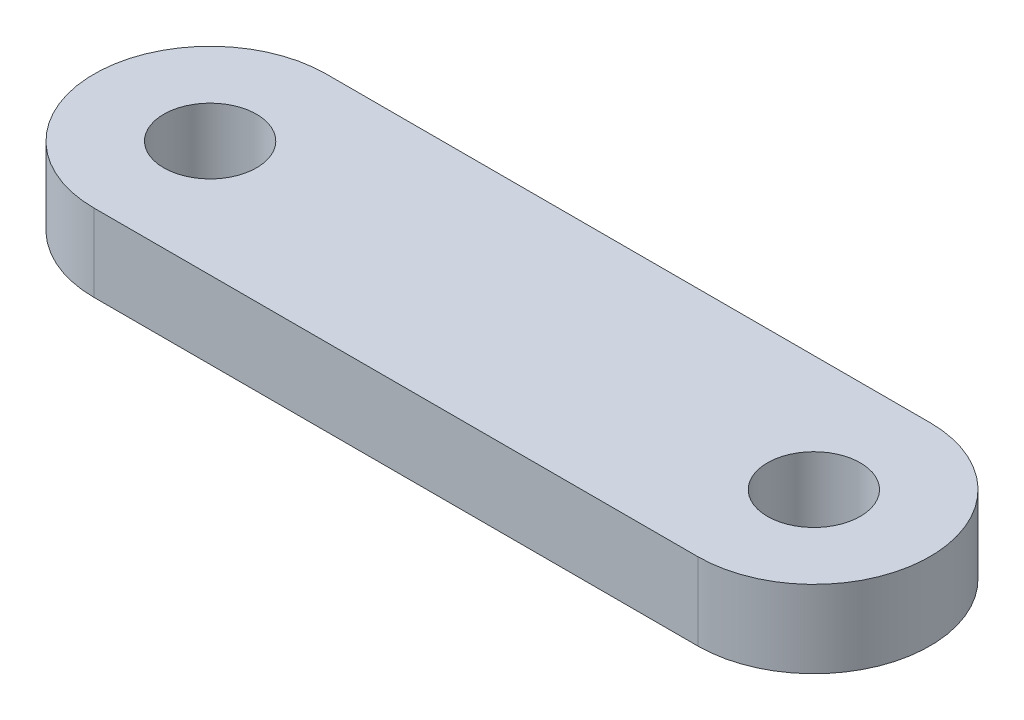
ISO-10303-21;
HEADER;
FILE_DESCRIPTION(('STEP AP214'),'2;1');
FILE_NAME('part.step','',(''),(''),'','','');
FILE_SCHEMA(('AUTOMOTIVE_DESIGN { 1 0 10303 214 1 1 1 1 }'));
ENDSEC;
DATA;
#1=APPLICATION_CONTEXT('core data for automotive mechanical design processes');
#2=APPLICATION_PROTOCOL_DEFINITION('international standard','automotive_design',2000,#1);
#3=PRODUCT_CONTEXT('',#1,'mechanical');
#4=PRODUCT('Part','Part','',(#3));
#5=PRODUCT_RELATED_PRODUCT_CATEGORY('part','',(#4));
#6=PRODUCT_DEFINITION_FORMATION('','',#4);
#7=PRODUCT_DEFINITION_CONTEXT('part definition',#1,'design');
#8=PRODUCT_DEFINITION('design','',#6,#7);
#9=PRODUCT_DEFINITION_SHAPE('','',#8);
#10=(LENGTH_UNIT() NAMED_UNIT(*) SI_UNIT(.MILLI.,.METRE.));
#11=(NAMED_UNIT(*) PLANE_ANGLE_UNIT() SI_UNIT($,.RADIAN.));
#12=(NAMED_UNIT(*) SI_UNIT($,.STERADIAN.) SOLID_ANGLE_UNIT());
#13=UNCERTAINTY_MEASURE_WITH_UNIT(LENGTH_MEASURE(1.E-05),#10,'distance_accuracy_value','');
#14=(GEOMETRIC_REPRESENTATION_CONTEXT(3) GLOBAL_UNCERTAINTY_ASSIGNED_CONTEXT((#13)) GLOBAL_UNIT_ASSIGNED_CONTEXT((#10,
#11,#12)) REPRESENTATION_CONTEXT('',''));
#15=CARTESIAN_POINT('',(0.,0.,0.));
#16=DIRECTION('',(0.,0.,1.));
#17=DIRECTION('',(1.,0.,0.));
#18=AXIS2_PLACEMENT_3D('',#15,#16,#17);
#19=CARTESIAN_POINT('',(0.,5.,0.));
#20=DIRECTION('',(0.,1.,0.));
#21=DIRECTION('',(0.,0.,1.));
#22=AXIS2_PLACEMENT_3D('',#19,#20,#21);
#23=PLANE('',#22);
#24=CARTESIAN_POINT('',(39.,5.,0.));
#25=DIRECTION('',(0.,1.,0.));
#26=DIRECTION('',(0.,0.,1.));
#27=AXIS2_PLACEMENT_3D('',#24,#25,#26);
#28=CIRCLE('',#27,3.00000000000001);
#29=CARTESIAN_POINT('',(39.,5.,3.00000000000001));
#30=VERTEX_POINT('',#29);
#31=EDGE_CURVE('E106',#30,#30,#28,.T.);
#32=ORIENTED_EDGE('',*,*,#31,.F.);
#33=EDGE_LOOP('',(#32));
#34=FACE_BOUND('',#33,.T.);
#35=CARTESIAN_POINT('',(0.,5.,0.));
#36=DIRECTION('',(0.,1.,0.));
#37=DIRECTION('',(0.,0.,1.));
#38=AXIS2_PLACEMENT_3D('',#35,#36,#37);
#39=CIRCLE('',#38,7.5);
#40=CARTESIAN_POINT('',(0.,5.,-7.5));
#41=VERTEX_POINT('',#40);
#42=CARTESIAN_POINT('',(0.,5.,7.5));
#43=VERTEX_POINT('',#42);
#44=EDGE_CURVE('E91',#41,#43,#39,.T.);
#45=ORIENTED_EDGE('',*,*,#44,.T.);
#46=DIRECTION('',(1.,0.,0.));
#47=VECTOR('',#46,1.);
#48=CARTESIAN_POINT('',(0.,5.,7.5));
#49=LINE('',#48,#47);
#50=CARTESIAN_POINT('',(39.,5.,7.5));
#51=VERTEX_POINT('',#50);
#52=EDGE_CURVE('E86',#43,#51,#49,.T.);
#53=ORIENTED_EDGE('',*,*,#52,.T.);
#54=CARTESIAN_POINT('',(39.,5.,0.));
#55=DIRECTION('',(0.,1.,0.));
#56=DIRECTION('',(0.,0.,1.));
#57=AXIS2_PLACEMENT_3D('',#54,#55,#56);
#58=CIRCLE('',#57,7.5);
#59=CARTESIAN_POINT('',(39.,5.,-7.5));
#60=VERTEX_POINT('',#59);
#61=EDGE_CURVE('E89',#51,#60,#58,.T.);
#62=ORIENTED_EDGE('',*,*,#61,.T.);
#63=DIRECTION('',(-1.,0.,0.));
#64=VECTOR('',#63,1.);
#65=CARTESIAN_POINT('',(0.,5.,-7.5));
#66=LINE('',#65,#64);
#67=EDGE_CURVE('E56',#60,#41,#66,.T.);
#68=ORIENTED_EDGE('',*,*,#67,.T.);
#69=EDGE_LOOP('',(#45,#53,#62,#68));
#70=FACE_BOUND('',#69,.T.);
#71=CARTESIAN_POINT('',(0.,5.,0.));
#72=DIRECTION('',(0.,1.,0.));
#73=DIRECTION('',(0.,0.,1.));
#74=AXIS2_PLACEMENT_3D('',#71,#72,#73);
#75=CIRCLE('',#74,3.);
#76=CARTESIAN_POINT('',(0.,5.,3.));
#77=VERTEX_POINT('',#76);
#78=EDGE_CURVE('E121',#77,#77,#75,.T.);
#79=ORIENTED_EDGE('',*,*,#78,.F.);
#80=EDGE_LOOP('',(#79));
#81=FACE_BOUND('',#80,.T.);
#82=ADVANCED_FACE('F39',(#34,#70,#81),#23,.T.);
#83=CARTESIAN_POINT('',(0.,0.,0.));
#84=DIRECTION('',(0.,1.,0.));
#85=DIRECTION('',(0.,0.,1.));
#86=AXIS2_PLACEMENT_3D('',#83,#84,#85);
#87=PLANE('',#86);
#88=CARTESIAN_POINT('',(0.,0.,0.));
#89=DIRECTION('',(0.,1.,0.));
#90=DIRECTION('',(0.,0.,1.));
#91=AXIS2_PLACEMENT_3D('',#88,#89,#90);
#92=CIRCLE('',#91,7.5);
#93=CARTESIAN_POINT('',(0.,0.,-7.5));
#94=VERTEX_POINT('',#93);
#95=CARTESIAN_POINT('',(0.,0.,7.5));
#96=VERTEX_POINT('',#95);
#97=EDGE_CURVE('E103',#94,#96,#92,.T.);
#98=ORIENTED_EDGE('',*,*,#97,.F.);
#99=DIRECTION('',(-1.,0.,0.));
#100=VECTOR('',#99,1.);
#101=CARTESIAN_POINT('',(0.,0.,-7.5));
#102=LINE('',#101,#100);
#103=CARTESIAN_POINT('',(39.,0.,-7.5));
#104=VERTEX_POINT('',#103);
#105=EDGE_CURVE('E79',#104,#94,#102,.T.);
#106=ORIENTED_EDGE('',*,*,#105,.F.);
#107=CARTESIAN_POINT('',(39.,0.,0.));
#108=DIRECTION('',(0.,1.,0.));
#109=DIRECTION('',(0.,0.,1.));
#110=AXIS2_PLACEMENT_3D('',#107,#108,#109);
#111=CIRCLE('',#110,7.5);
#112=CARTESIAN_POINT('',(39.,0.,7.5));
#113=VERTEX_POINT('',#112);
#114=EDGE_CURVE('E73',#113,#104,#111,.T.);
#115=ORIENTED_EDGE('',*,*,#114,.F.);
#116=DIRECTION('',(1.,0.,0.));
#117=VECTOR('',#116,1.);
#118=CARTESIAN_POINT('',(0.,0.,7.5));
#119=LINE('',#118,#117);
#120=EDGE_CURVE('E95',#96,#113,#119,.T.);
#121=ORIENTED_EDGE('',*,*,#120,.F.);
#122=EDGE_LOOP('',(#98,#106,#115,#121));
#123=FACE_BOUND('',#122,.T.);
#124=CARTESIAN_POINT('',(39.,0.,0.));
#125=DIRECTION('',(0.,1.,0.));
#126=DIRECTION('',(0.,0.,1.));
#127=AXIS2_PLACEMENT_3D('',#124,#125,#126);
#128=CIRCLE('',#127,3.00000000000001);
#129=CARTESIAN_POINT('',(39.,0.,3.00000000000001));
#130=VERTEX_POINT('',#129);
#131=EDGE_CURVE('E118',#130,#130,#128,.T.);
#132=ORIENTED_EDGE('',*,*,#131,.T.);
#133=EDGE_LOOP('',(#132));
#134=FACE_BOUND('',#133,.T.);
#135=CARTESIAN_POINT('',(0.,0.,0.));
#136=DIRECTION('',(0.,1.,0.));
#137=DIRECTION('',(0.,0.,1.));
#138=AXIS2_PLACEMENT_3D('',#135,#136,#137);
#139=CIRCLE('',#138,3.);
#140=CARTESIAN_POINT('',(0.,0.,3.));
#141=VERTEX_POINT('',#140);
#142=EDGE_CURVE('E124',#141,#141,#139,.T.);
#143=ORIENTED_EDGE('',*,*,#142,.T.);
#144=EDGE_LOOP('',(#143));
#145=FACE_BOUND('',#144,.T.);
#146=ADVANCED_FACE('F114',(#123,#134,#145),#87,.F.);
#147=CARTESIAN_POINT('',(0.,5.,0.));
#148=DIRECTION('',(0.,-1.,0.));
#149=DIRECTION('',(0.,0.,-1.));
#150=AXIS2_PLACEMENT_3D('',#147,#148,#149);
#151=CYLINDRICAL_SURFACE('',#150,7.5);
#152=ORIENTED_EDGE('',*,*,#97,.T.);
#153=DIRECTION('',(0.,-1.,0.));
#154=VECTOR('',#153,1.);
#155=CARTESIAN_POINT('',(0.,5.,7.5));
#156=LINE('',#155,#154);
#157=EDGE_CURVE('E11',#43,#96,#156,.T.);
#158=ORIENTED_EDGE('',*,*,#157,.F.);
#159=ORIENTED_EDGE('',*,*,#44,.F.);
#160=DIRECTION('',(0.,-1.,0.));
#161=VECTOR('',#160,1.);
#162=CARTESIAN_POINT('',(0.,5.,-7.5));
#163=LINE('',#162,#161);
#164=EDGE_CURVE('E99',#41,#94,#163,.T.);
#165=ORIENTED_EDGE('',*,*,#164,.T.);
#166=EDGE_LOOP('',(#152,#158,#159,#165));
#167=FACE_BOUND('',#166,.T.);
#168=ADVANCED_FACE('F41',(#167),#151,.T.);
#169=CARTESIAN_POINT('',(0.,5.,7.5));
#170=DIRECTION('',(0.,0.,-1.));
#171=DIRECTION('',(-1.,0.,0.));
#172=AXIS2_PLACEMENT_3D('',#169,#170,#171);
#173=PLANE('',#172);
#174=ORIENTED_EDGE('',*,*,#120,.T.);
#175=DIRECTION('',(0.,-1.,0.));
#176=VECTOR('',#175,1.);
#177=CARTESIAN_POINT('',(39.,5.,7.5));
#178=LINE('',#177,#176);
#179=EDGE_CURVE('E48',#51,#113,#178,.T.);
#180=ORIENTED_EDGE('',*,*,#179,.F.);
#181=ORIENTED_EDGE('',*,*,#52,.F.);
#182=ORIENTED_EDGE('',*,*,#157,.T.);
#183=EDGE_LOOP('',(#174,#180,#181,#182));
#184=FACE_BOUND('',#183,.T.);
#185=ADVANCED_FACE('F94',(#184),#173,.F.);
#186=CARTESIAN_POINT('',(39.,5.,0.));
#187=DIRECTION('',(0.,-1.,0.));
#188=DIRECTION('',(0.,0.,-1.));
#189=AXIS2_PLACEMENT_3D('',#186,#187,#188);
#190=CYLINDRICAL_SURFACE('',#189,7.5);
#191=ORIENTED_EDGE('',*,*,#114,.T.);
#192=DIRECTION('',(0.,-1.,0.));
#193=VECTOR('',#192,1.);
#194=CARTESIAN_POINT('',(39.,5.,-7.5));
#195=LINE('',#194,#193);
#196=EDGE_CURVE('E96',#60,#104,#195,.T.);
#197=ORIENTED_EDGE('',*,*,#196,.F.);
#198=ORIENTED_EDGE('',*,*,#61,.F.);
#199=ORIENTED_EDGE('',*,*,#179,.T.);
#200=EDGE_LOOP('',(#191,#197,#198,#199));
#201=FACE_BOUND('',#200,.T.);
#202=ADVANCED_FACE('F97',(#201),#190,.T.);
#203=CARTESIAN_POINT('',(0.,5.,-7.5));
#204=DIRECTION('',(0.,0.,1.));
#205=DIRECTION('',(1.,0.,0.));
#206=AXIS2_PLACEMENT_3D('',#203,#204,#205);
#207=PLANE('',#206);
#208=ORIENTED_EDGE('',*,*,#105,.T.);
#209=ORIENTED_EDGE('',*,*,#164,.F.);
#210=ORIENTED_EDGE('',*,*,#67,.F.);
#211=ORIENTED_EDGE('',*,*,#196,.T.);
#212=EDGE_LOOP('',(#208,#209,#210,#211));
#213=FACE_BOUND('',#212,.T.);
#214=ADVANCED_FACE('F111',(#213),#207,.F.);
#215=CARTESIAN_POINT('',(39.,5.,0.));
#216=DIRECTION('',(0.,-1.,0.));
#217=DIRECTION('',(0.,0.,-1.));
#218=AXIS2_PLACEMENT_3D('',#215,#216,#217);
#219=CYLINDRICAL_SURFACE('',#218,3.00000000000001);
#220=ORIENTED_EDGE('',*,*,#31,.T.);
#221=EDGE_LOOP('',(#220));
#222=FACE_BOUND('',#221,.T.);
#223=ORIENTED_EDGE('',*,*,#131,.F.);
#224=EDGE_LOOP('',(#223));
#225=FACE_BOUND('',#224,.T.);
#226=ADVANCED_FACE('F141',(#222,#225),#219,.F.);
#227=CARTESIAN_POINT('',(0.,5.,0.));
#228=DIRECTION('',(0.,-1.,0.));
#229=DIRECTION('',(0.,0.,-1.));
#230=AXIS2_PLACEMENT_3D('',#227,#228,#229);
#231=CYLINDRICAL_SURFACE('',#230,3.);
#232=ORIENTED_EDGE('',*,*,#78,.T.);
#233=EDGE_LOOP('',(#232));
#234=FACE_BOUND('',#233,.T.);
#235=ORIENTED_EDGE('',*,*,#142,.F.);
#236=EDGE_LOOP('',(#235));
#237=FACE_BOUND('',#236,.T.);
#238=ADVANCED_FACE('F130',(#234,#237),#231,.F.);
#239=CLOSED_SHELL('',(#82,#146,#168,#185,#202,#214,#226,#238));
#240=MANIFOLD_SOLID_BREP('B2',#239);
#241=ADVANCED_BREP_SHAPE_REPRESENTATION('',(#18,#240),#14);
#242=SHAPE_DEFINITION_REPRESENTATION(#9,#241);
ENDSEC;
END-ISO-10303-21;
